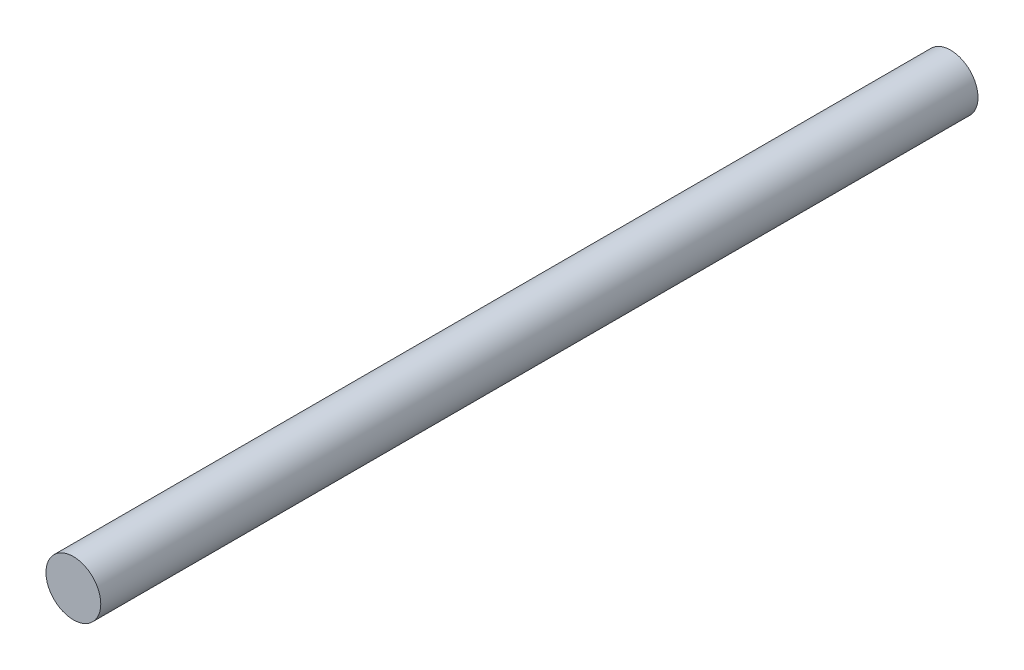
ISO-10303-21;
HEADER;
FILE_DESCRIPTION(('STEP AP214'),'2;1');
FILE_NAME('part.step','',(''),(''),'','','');
FILE_SCHEMA(('AUTOMOTIVE_DESIGN { 1 0 10303 214 1 1 1 1 }'));
ENDSEC;
DATA;
#1=APPLICATION_CONTEXT('core data for automotive mechanical design processes');
#2=APPLICATION_PROTOCOL_DEFINITION('international standard','automotive_design',2000,#1);
#3=PRODUCT_CONTEXT('',#1,'mechanical');
#4=PRODUCT('Part','Part','',(#3));
#5=PRODUCT_RELATED_PRODUCT_CATEGORY('part','',(#4));
#6=PRODUCT_DEFINITION_FORMATION('','',#4);
#7=PRODUCT_DEFINITION_CONTEXT('part definition',#1,'design');
#8=PRODUCT_DEFINITION('design','',#6,#7);
#9=PRODUCT_DEFINITION_SHAPE('','',#8);
#10=(LENGTH_UNIT() NAMED_UNIT(*) SI_UNIT(.MILLI.,.METRE.));
#11=(NAMED_UNIT(*) PLANE_ANGLE_UNIT() SI_UNIT($,.RADIAN.));
#12=(NAMED_UNIT(*) SI_UNIT($,.STERADIAN.) SOLID_ANGLE_UNIT());
#13=UNCERTAINTY_MEASURE_WITH_UNIT(LENGTH_MEASURE(1.E-05),#10,'distance_accuracy_value','');
#14=(GEOMETRIC_REPRESENTATION_CONTEXT(3) GLOBAL_UNCERTAINTY_ASSIGNED_CONTEXT((#13)) GLOBAL_UNIT_ASSIGNED_CONTEXT((#10,
#11,#12)) REPRESENTATION_CONTEXT('',''));
#15=CARTESIAN_POINT('',(0.,0.,0.));
#16=DIRECTION('',(0.,0.,1.));
#17=DIRECTION('',(1.,0.,0.));
#18=AXIS2_PLACEMENT_3D('',#15,#16,#17);
#19=CARTESIAN_POINT('',(0.,0.,101.6));
#20=DIRECTION('',(0.,0.,-1.));
#21=DIRECTION('',(-1.,0.,0.));
#22=AXIS2_PLACEMENT_3D('',#19,#20,#21);
#23=CYLINDRICAL_SURFACE('',#22,3.175);
#24=CARTESIAN_POINT('',(0.,0.,101.6));
#25=DIRECTION('',(0.,0.,1.));
#26=DIRECTION('',(1.,0.,0.));
#27=AXIS2_PLACEMENT_3D('',#24,#25,#26);
#28=CIRCLE('',#27,3.175);
#29=CARTESIAN_POINT('',(3.175,0.,101.6));
#30=VERTEX_POINT('',#29);
#31=EDGE_CURVE('E10',#30,#30,#28,.T.);
#32=ORIENTED_EDGE('',*,*,#31,.F.);
#33=EDGE_LOOP('',(#32));
#34=FACE_BOUND('',#33,.T.);
#35=CARTESIAN_POINT('',(0.,0.,0.));
#36=DIRECTION('',(0.,0.,1.));
#37=DIRECTION('',(1.,0.,0.));
#38=AXIS2_PLACEMENT_3D('',#35,#36,#37);
#39=CIRCLE('',#38,3.175);
#40=CARTESIAN_POINT('',(3.175,0.,0.));
#41=VERTEX_POINT('',#40);
#42=EDGE_CURVE('E44',#41,#41,#39,.T.);
#43=ORIENTED_EDGE('',*,*,#42,.T.);
#44=EDGE_LOOP('',(#43));
#45=FACE_BOUND('',#44,.T.);
#46=ADVANCED_FACE('F41',(#34,#45),#23,.T.);
#47=CARTESIAN_POINT('',(0.,0.,101.6));
#48=DIRECTION('',(0.,0.,1.));
#49=DIRECTION('',(1.,0.,0.));
#50=AXIS2_PLACEMENT_3D('',#47,#48,#49);
#51=PLANE('',#50);
#52=ORIENTED_EDGE('',*,*,#31,.T.);
#53=EDGE_LOOP('',(#52));
#54=FACE_BOUND('',#53,.T.);
#55=ADVANCED_FACE('F58',(#54),#51,.T.);
#56=CARTESIAN_POINT('',(0.,0.,0.));
#57=DIRECTION('',(0.,0.,1.));
#58=DIRECTION('',(1.,0.,0.));
#59=AXIS2_PLACEMENT_3D('',#56,#57,#58);
#60=PLANE('',#59);
#61=ORIENTED_EDGE('',*,*,#42,.F.);
#62=EDGE_LOOP('',(#61));
#63=FACE_BOUND('',#62,.T.);
#64=ADVANCED_FACE('F56',(#63),#60,.F.);
#65=CLOSED_SHELL('',(#46,#55,#64));
#66=MANIFOLD_SOLID_BREP('B2',#65);
#67=ADVANCED_BREP_SHAPE_REPRESENTATION('',(#18,#66),#14);
#68=SHAPE_DEFINITION_REPRESENTATION(#9,#67);
ENDSEC;
END-ISO-10303-21;
